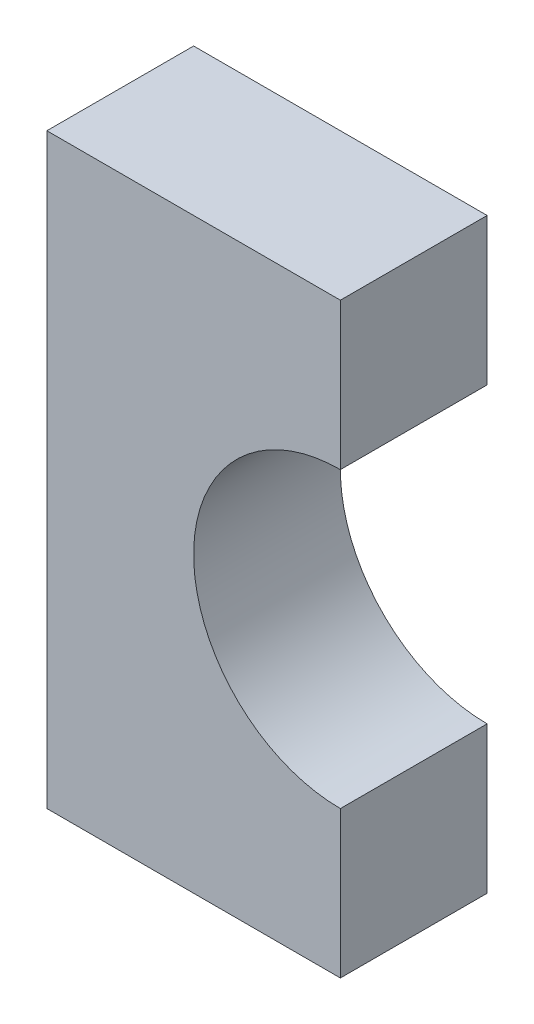
ISO-10303-21;
HEADER;
FILE_DESCRIPTION(('STEP AP214'),'2;1');
FILE_NAME('part.step','',(''),(''),'','','');
FILE_SCHEMA(('AUTOMOTIVE_DESIGN { 1 0 10303 214 1 1 1 1 }'));
ENDSEC;
DATA;
#1=APPLICATION_CONTEXT('core data for automotive mechanical design processes');
#2=APPLICATION_PROTOCOL_DEFINITION('international standard','automotive_design',2000,#1);
#3=PRODUCT_CONTEXT('',#1,'mechanical');
#4=PRODUCT('Part','Part','',(#3));
#5=PRODUCT_RELATED_PRODUCT_CATEGORY('part','',(#4));
#6=PRODUCT_DEFINITION_FORMATION('','',#4);
#7=PRODUCT_DEFINITION_CONTEXT('part definition',#1,'design');
#8=PRODUCT_DEFINITION('design','',#6,#7);
#9=PRODUCT_DEFINITION_SHAPE('','',#8);
#10=(LENGTH_UNIT() NAMED_UNIT(*) SI_UNIT(.MILLI.,.METRE.));
#11=(NAMED_UNIT(*) PLANE_ANGLE_UNIT() SI_UNIT($,.RADIAN.));
#12=(NAMED_UNIT(*) SI_UNIT($,.STERADIAN.) SOLID_ANGLE_UNIT());
#13=UNCERTAINTY_MEASURE_WITH_UNIT(LENGTH_MEASURE(1.E-05),#10,'distance_accuracy_value','');
#14=(GEOMETRIC_REPRESENTATION_CONTEXT(3) GLOBAL_UNCERTAINTY_ASSIGNED_CONTEXT((#13)) GLOBAL_UNIT_ASSIGNED_CONTEXT((#10,
#11,#12)) REPRESENTATION_CONTEXT('',''));
#15=CARTESIAN_POINT('',(0.,0.,0.));
#16=DIRECTION('',(0.,0.,1.));
#17=DIRECTION('',(1.,0.,0.));
#18=AXIS2_PLACEMENT_3D('',#15,#16,#17);
#19=CARTESIAN_POINT('',(0.4,0.4,0.2));
#20=DIRECTION('',(0.,0.,1.));
#21=DIRECTION('',(1.,0.,0.));
#22=AXIS2_PLACEMENT_3D('',#19,#20,#21);
#23=PLANE('',#22);
#24=CARTESIAN_POINT('',(0.8,0.,0.2));
#25=DIRECTION('',(0.,0.,-1.));
#26=DIRECTION('',(1.,0.,0.));
#27=AXIS2_PLACEMENT_3D('',#24,#25,#26);
#28=CIRCLE('',#27,0.2);
#29=CARTESIAN_POINT('',(0.8,-0.2,0.2));
#30=VERTEX_POINT('',#29);
#31=CARTESIAN_POINT('',(0.8,0.2,0.2));
#32=VERTEX_POINT('',#31);
#33=EDGE_CURVE('E92',#30,#32,#28,.T.);
#34=ORIENTED_EDGE('',*,*,#33,.T.);
#35=DIRECTION('',(0.,-1.,0.));
#36=VECTOR('',#35,1.);
#37=CARTESIAN_POINT('',(0.8,0.4,0.2));
#38=LINE('',#37,#36);
#39=CARTESIAN_POINT('',(0.8,0.4,0.2));
#40=VERTEX_POINT('',#39);
#41=EDGE_CURVE('E97',#40,#32,#38,.T.);
#42=ORIENTED_EDGE('',*,*,#41,.F.);
#43=DIRECTION('',(1.,0.,0.));
#44=VECTOR('',#43,1.);
#45=CARTESIAN_POINT('',(0.4,0.4,0.2));
#46=LINE('',#45,#44);
#47=CARTESIAN_POINT('',(0.4,0.4,0.2));
#48=VERTEX_POINT('',#47);
#49=EDGE_CURVE('E11',#48,#40,#46,.T.);
#50=ORIENTED_EDGE('',*,*,#49,.F.);
#51=DIRECTION('',(0.,1.,0.));
#52=VECTOR('',#51,1.);
#53=CARTESIAN_POINT('',(0.4,-0.4,0.2));
#54=LINE('',#53,#52);
#55=CARTESIAN_POINT('',(0.4,-0.4,0.2));
#56=VERTEX_POINT('',#55);
#57=EDGE_CURVE('E27',#56,#48,#54,.T.);
#58=ORIENTED_EDGE('',*,*,#57,.F.);
#59=DIRECTION('',(-1.,0.,0.));
#60=VECTOR('',#59,1.);
#61=CARTESIAN_POINT('',(0.8,-0.4,0.2));
#62=LINE('',#61,#60);
#63=CARTESIAN_POINT('',(0.8,-0.4,0.2));
#64=VERTEX_POINT('',#63);
#65=EDGE_CURVE('E58',#64,#56,#62,.T.);
#66=ORIENTED_EDGE('',*,*,#65,.F.);
#67=DIRECTION('',(0.,-1.,0.));
#68=VECTOR('',#67,1.);
#69=CARTESIAN_POINT('',(0.8,0.4,0.2));
#70=LINE('',#69,#68);
#71=EDGE_CURVE('E61',#30,#64,#70,.T.);
#72=ORIENTED_EDGE('',*,*,#71,.F.);
#73=EDGE_LOOP('',(#34,#42,#50,#58,#66,#72));
#74=FACE_BOUND('',#73,.T.);
#75=ADVANCED_FACE('F17',(#74),#23,.T.);
#76=CARTESIAN_POINT('',(0.4,0.4,0.));
#77=DIRECTION('',(0.,1.,0.));
#78=DIRECTION('',(1.,0.,0.));
#79=AXIS2_PLACEMENT_3D('',#76,#77,#78);
#80=PLANE('',#79);
#81=DIRECTION('',(0.,0.,1.));
#82=VECTOR('',#81,1.);
#83=CARTESIAN_POINT('',(0.8,0.4,0.));
#84=LINE('',#83,#82);
#85=CARTESIAN_POINT('',(0.8,0.4,0.));
#86=VERTEX_POINT('',#85);
#87=EDGE_CURVE('E106',#86,#40,#84,.T.);
#88=ORIENTED_EDGE('',*,*,#87,.F.);
#89=DIRECTION('',(-1.,0.,0.));
#90=VECTOR('',#89,1.);
#91=CARTESIAN_POINT('',(0.4,0.4,0.));
#92=LINE('',#91,#90);
#93=CARTESIAN_POINT('',(0.4,0.4,0.));
#94=VERTEX_POINT('',#93);
#95=EDGE_CURVE('E138',#86,#94,#92,.T.);
#96=ORIENTED_EDGE('',*,*,#95,.T.);
#97=DIRECTION('',(0.,0.,-1.));
#98=VECTOR('',#97,1.);
#99=CARTESIAN_POINT('',(0.4,0.4,0.));
#100=LINE('',#99,#98);
#101=EDGE_CURVE('E67',#48,#94,#100,.T.);
#102=ORIENTED_EDGE('',*,*,#101,.F.);
#103=ORIENTED_EDGE('',*,*,#49,.T.);
#104=EDGE_LOOP('',(#88,#96,#102,#103));
#105=FACE_BOUND('',#104,.T.);
#106=ADVANCED_FACE('F147',(#105),#80,.T.);
#107=CARTESIAN_POINT('',(0.4,-0.4,0.));
#108=DIRECTION('',(-1.,0.,0.));
#109=DIRECTION('',(0.,0.,1.));
#110=AXIS2_PLACEMENT_3D('',#107,#108,#109);
#111=PLANE('',#110);
#112=ORIENTED_EDGE('',*,*,#101,.T.);
#113=DIRECTION('',(0.,-1.,0.));
#114=VECTOR('',#113,1.);
#115=CARTESIAN_POINT('',(0.4,0.4,0.));
#116=LINE('',#115,#114);
#117=CARTESIAN_POINT('',(0.4,-0.4,0.));
#118=VERTEX_POINT('',#117);
#119=EDGE_CURVE('E134',#94,#118,#116,.T.);
#120=ORIENTED_EDGE('',*,*,#119,.T.);
#121=DIRECTION('',(0.,0.,-1.));
#122=VECTOR('',#121,1.);
#123=CARTESIAN_POINT('',(0.4,-0.4,0.));
#124=LINE('',#123,#122);
#125=EDGE_CURVE('E68',#56,#118,#124,.T.);
#126=ORIENTED_EDGE('',*,*,#125,.F.);
#127=ORIENTED_EDGE('',*,*,#57,.T.);
#128=EDGE_LOOP('',(#112,#120,#126,#127));
#129=FACE_BOUND('',#128,.T.);
#130=ADVANCED_FACE('F19',(#129),#111,.T.);
#131=CARTESIAN_POINT('',(0.8,-0.4,0.));
#132=DIRECTION('',(0.,-1.,0.));
#133=DIRECTION('',(0.,0.,-1.));
#134=AXIS2_PLACEMENT_3D('',#131,#132,#133);
#135=PLANE('',#134);
#136=ORIENTED_EDGE('',*,*,#125,.T.);
#137=DIRECTION('',(1.,0.,0.));
#138=VECTOR('',#137,1.);
#139=CARTESIAN_POINT('',(0.4,-0.4,0.));
#140=LINE('',#139,#138);
#141=CARTESIAN_POINT('',(0.8,-0.4,0.));
#142=VERTEX_POINT('',#141);
#143=EDGE_CURVE('E76',#118,#142,#140,.T.);
#144=ORIENTED_EDGE('',*,*,#143,.T.);
#145=DIRECTION('',(0.,0.,-1.));
#146=VECTOR('',#145,1.);
#147=CARTESIAN_POINT('',(0.8,-0.4,0.));
#148=LINE('',#147,#146);
#149=EDGE_CURVE('E72',#64,#142,#148,.T.);
#150=ORIENTED_EDGE('',*,*,#149,.F.);
#151=ORIENTED_EDGE('',*,*,#65,.T.);
#152=EDGE_LOOP('',(#136,#144,#150,#151));
#153=FACE_BOUND('',#152,.T.);
#154=ADVANCED_FACE('F73',(#153),#135,.T.);
#155=CARTESIAN_POINT('',(0.8,0.4,0.));
#156=DIRECTION('',(1.,0.,0.));
#157=DIRECTION('',(0.,1.,0.));
#158=AXIS2_PLACEMENT_3D('',#155,#156,#157);
#159=PLANE('',#158);
#160=ORIENTED_EDGE('',*,*,#71,.T.);
#161=ORIENTED_EDGE('',*,*,#149,.T.);
#162=DIRECTION('',(0.,1.,0.));
#163=VECTOR('',#162,1.);
#164=CARTESIAN_POINT('',(0.8,0.4,0.));
#165=LINE('',#164,#163);
#166=CARTESIAN_POINT('',(0.8,-0.2,0.));
#167=VERTEX_POINT('',#166);
#168=EDGE_CURVE('E126',#142,#167,#165,.T.);
#169=ORIENTED_EDGE('',*,*,#168,.T.);
#170=DIRECTION('',(0.,0.,1.));
#171=VECTOR('',#170,1.);
#172=CARTESIAN_POINT('',(0.8,-0.2,0.2));
#173=LINE('',#172,#171);
#174=EDGE_CURVE('E84',#167,#30,#173,.T.);
#175=ORIENTED_EDGE('',*,*,#174,.T.);
#176=EDGE_LOOP('',(#160,#161,#169,#175));
#177=FACE_BOUND('',#176,.T.);
#178=ADVANCED_FACE('F82',(#177),#159,.T.);
#179=CARTESIAN_POINT('',(0.8,0.,0.2));
#180=DIRECTION('',(0.,0.,1.));
#181=DIRECTION('',(1.,0.,0.));
#182=AXIS2_PLACEMENT_3D('',#179,#180,#181);
#183=CYLINDRICAL_SURFACE('',#182,0.2);
#184=CARTESIAN_POINT('',(0.8,0.,0.));
#185=DIRECTION('',(0.,0.,-1.));
#186=DIRECTION('',(1.,0.,0.));
#187=AXIS2_PLACEMENT_3D('',#184,#185,#186);
#188=CIRCLE('',#187,0.2);
#189=CARTESIAN_POINT('',(0.8,0.2,0.));
#190=VERTEX_POINT('',#189);
#191=EDGE_CURVE('E122',#167,#190,#188,.T.);
#192=ORIENTED_EDGE('',*,*,#191,.T.);
#193=DIRECTION('',(0.,0.,-1.));
#194=VECTOR('',#193,1.);
#195=CARTESIAN_POINT('',(0.8,0.2,0.));
#196=LINE('',#195,#194);
#197=EDGE_CURVE('E101',#32,#190,#196,.T.);
#198=ORIENTED_EDGE('',*,*,#197,.F.);
#199=ORIENTED_EDGE('',*,*,#33,.F.);
#200=ORIENTED_EDGE('',*,*,#174,.F.);
#201=EDGE_LOOP('',(#192,#198,#199,#200));
#202=FACE_BOUND('',#201,.T.);
#203=ADVANCED_FACE('F171',(#202),#183,.F.);
#204=CARTESIAN_POINT('',(0.8,0.4,0.));
#205=DIRECTION('',(1.,0.,0.));
#206=DIRECTION('',(0.,1.,0.));
#207=AXIS2_PLACEMENT_3D('',#204,#205,#206);
#208=PLANE('',#207);
#209=ORIENTED_EDGE('',*,*,#41,.T.);
#210=ORIENTED_EDGE('',*,*,#197,.T.);
#211=DIRECTION('',(0.,1.,0.));
#212=VECTOR('',#211,1.);
#213=CARTESIAN_POINT('',(0.8,0.4,0.));
#214=LINE('',#213,#212);
#215=EDGE_CURVE('E102',#190,#86,#214,.T.);
#216=ORIENTED_EDGE('',*,*,#215,.T.);
#217=ORIENTED_EDGE('',*,*,#87,.T.);
#218=EDGE_LOOP('',(#209,#210,#216,#217));
#219=FACE_BOUND('',#218,.T.);
#220=ADVANCED_FACE('F169',(#219),#208,.T.);
#221=CARTESIAN_POINT('',(0.4,0.4,0.));
#222=DIRECTION('',(0.,0.,1.));
#223=DIRECTION('',(1.,0.,0.));
#224=AXIS2_PLACEMENT_3D('',#221,#222,#223);
#225=PLANE('',#224);
#226=ORIENTED_EDGE('',*,*,#191,.F.);
#227=ORIENTED_EDGE('',*,*,#168,.F.);
#228=ORIENTED_EDGE('',*,*,#143,.F.);
#229=ORIENTED_EDGE('',*,*,#119,.F.);
#230=ORIENTED_EDGE('',*,*,#95,.F.);
#231=ORIENTED_EDGE('',*,*,#215,.F.);
#232=EDGE_LOOP('',(#226,#227,#228,#229,#230,#231));
#233=FACE_BOUND('',#232,.T.);
#234=ADVANCED_FACE('F153',(#233),#225,.F.);
#235=CLOSED_SHELL('',(#75,#106,#130,#154,#178,#203,#220,#234));
#236=MANIFOLD_SOLID_BREP('B1',#235);
#237=ADVANCED_BREP_SHAPE_REPRESENTATION('',(#18,#236),#14);
#238=SHAPE_DEFINITION_REPRESENTATION(#9,#237);
ENDSEC;
END-ISO-10303-21;
